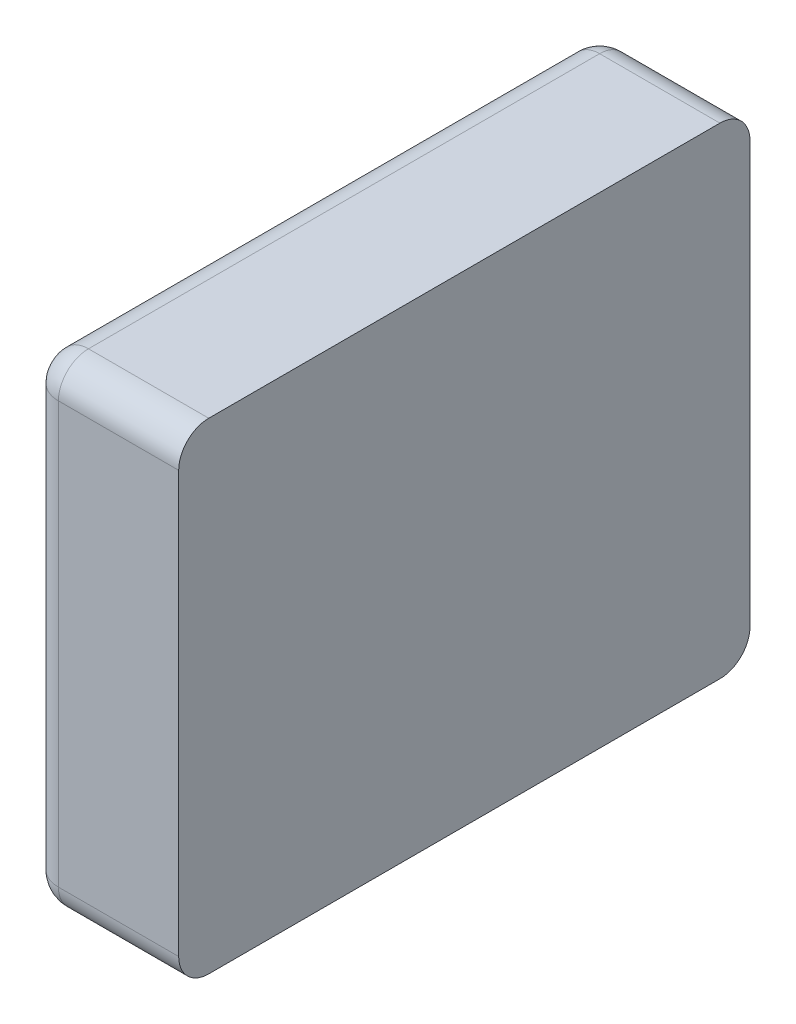
ISO-10303-21;
HEADER;
FILE_DESCRIPTION(('STEP AP214'),'2;1');
FILE_NAME('part.step','',(''),(''),'','','');
FILE_SCHEMA(('AUTOMOTIVE_DESIGN { 1 0 10303 214 1 1 1 1 }'));
ENDSEC;
DATA;
#1=APPLICATION_CONTEXT('core data for automotive mechanical design processes');
#2=APPLICATION_PROTOCOL_DEFINITION('international standard','automotive_design',2000,#1);
#3=PRODUCT_CONTEXT('',#1,'mechanical');
#4=PRODUCT('Part','Part','',(#3));
#5=PRODUCT_RELATED_PRODUCT_CATEGORY('part','',(#4));
#6=PRODUCT_DEFINITION_FORMATION('','',#4);
#7=PRODUCT_DEFINITION_CONTEXT('part definition',#1,'design');
#8=PRODUCT_DEFINITION('design','',#6,#7);
#9=PRODUCT_DEFINITION_SHAPE('','',#8);
#10=(LENGTH_UNIT() NAMED_UNIT(*) SI_UNIT(.MILLI.,.METRE.));
#11=(NAMED_UNIT(*) PLANE_ANGLE_UNIT() SI_UNIT($,.RADIAN.));
#12=(NAMED_UNIT(*) SI_UNIT($,.STERADIAN.) SOLID_ANGLE_UNIT());
#13=UNCERTAINTY_MEASURE_WITH_UNIT(LENGTH_MEASURE(1.E-05),#10,'distance_accuracy_value','');
#14=(GEOMETRIC_REPRESENTATION_CONTEXT(3) GLOBAL_UNCERTAINTY_ASSIGNED_CONTEXT((#13)) GLOBAL_UNIT_ASSIGNED_CONTEXT((#10,
#11,#12)) REPRESENTATION_CONTEXT('',''));
#15=CARTESIAN_POINT('',(0.,0.,0.));
#16=DIRECTION('',(0.,0.,1.));
#17=DIRECTION('',(1.,0.,0.));
#18=AXIS2_PLACEMENT_3D('',#15,#16,#17);
#19=CARTESIAN_POINT('',(-1.6,0.,0.));
#20=DIRECTION('',(-1.,0.,0.));
#21=DIRECTION('',(0.,0.,1.));
#22=AXIS2_PLACEMENT_3D('',#19,#20,#21);
#23=PLANE('',#22);
#24=DIRECTION('',(0.,0.,1.));
#25=VECTOR('',#24,1.);
#26=CARTESIAN_POINT('',(-1.6,0.7,0.));
#27=LINE('',#26,#25);
#28=CARTESIAN_POINT('',(-1.6,0.7,0.0999999999999998));
#29=VERTEX_POINT('',#28);
#30=CARTESIAN_POINT('',(-1.6,0.7,1.8));
#31=VERTEX_POINT('',#30);
#32=EDGE_CURVE('E115',#29,#31,#27,.T.);
#33=ORIENTED_EDGE('',*,*,#32,.F.);
#34=DIRECTION('',(0.,1.,0.));
#35=VECTOR('',#34,1.);
#36=CARTESIAN_POINT('',(-1.6,0.,0.0999999999999998));
#37=LINE('',#36,#35);
#38=CARTESIAN_POINT('',(-1.6,-0.7005,0.1));
#39=VERTEX_POINT('',#38);
#40=EDGE_CURVE('E112',#39,#29,#37,.T.);
#41=ORIENTED_EDGE('',*,*,#40,.F.);
#42=DIRECTION('',(0.,0.,-1.));
#43=VECTOR('',#42,1.);
#44=CARTESIAN_POINT('',(-1.6,-0.7005,0.));
#45=LINE('',#44,#43);
#46=CARTESIAN_POINT('',(-1.6,-0.7005,1.8));
#47=VERTEX_POINT('',#46);
#48=EDGE_CURVE('E101',#47,#39,#45,.T.);
#49=ORIENTED_EDGE('',*,*,#48,.F.);
#50=DIRECTION('',(0.,-1.,0.));
#51=VECTOR('',#50,1.);
#52=CARTESIAN_POINT('',(-1.6,0.,1.8));
#53=LINE('',#52,#51);
#54=EDGE_CURVE('E155',#31,#47,#53,.T.);
#55=ORIENTED_EDGE('',*,*,#54,.F.);
#56=EDGE_LOOP('',(#33,#41,#49,#55));
#57=FACE_BOUND('',#56,.T.);
#58=ADVANCED_FACE('F17',(#57),#23,.T.);
#59=CARTESIAN_POINT('',(-1.5,-0.7005,0.1));
#60=DIRECTION('',(1.,0.,0.));
#61=DIRECTION('',(0.,1.,0.));
#62=AXIS2_PLACEMENT_3D('',#59,#60,#61);
#63=SPHERICAL_SURFACE('',#62,0.1);
#64=CARTESIAN_POINT('',(-1.5,-0.7005,0.1));
#65=DIRECTION('',(1.,0.,0.));
#66=DIRECTION('',(0.,0.,-1.));
#67=AXIS2_PLACEMENT_3D('',#64,#65,#66);
#68=CIRCLE('',#67,0.1);
#69=CARTESIAN_POINT('',(-1.5,-0.8005,0.1));
#70=VERTEX_POINT('',#69);
#71=CARTESIAN_POINT('',(-1.5,-0.7005,0.));
#72=VERTEX_POINT('',#71);
#73=EDGE_CURVE('E117',#70,#72,#68,.T.);
#74=ORIENTED_EDGE('',*,*,#73,.F.);
#75=CARTESIAN_POINT('',(-1.5,-0.7005,0.1));
#76=DIRECTION('',(0.,0.,-1.));
#77=DIRECTION('',(0.,1.,0.));
#78=AXIS2_PLACEMENT_3D('',#75,#76,#77);
#79=CIRCLE('',#78,0.1);
#80=EDGE_CURVE('E106',#39,#70,#79,.F.);
#81=ORIENTED_EDGE('',*,*,#80,.F.);
#82=CARTESIAN_POINT('',(-1.5,-0.7005,0.1));
#83=DIRECTION('',(0.,1.,0.));
#84=DIRECTION('',(0.,0.,1.));
#85=AXIS2_PLACEMENT_3D('',#82,#83,#84);
#86=CIRCLE('',#85,0.1);
#87=EDGE_CURVE('E118',#72,#39,#86,.T.);
#88=ORIENTED_EDGE('',*,*,#87,.F.);
#89=EDGE_LOOP('',(#74,#81,#88));
#90=FACE_BOUND('',#89,.T.);
#91=ADVANCED_FACE('F125',(#90),#63,.T.);
#92=CARTESIAN_POINT('',(-1.5,-0.7005,0.));
#93=DIRECTION('',(0.,0.,-1.));
#94=DIRECTION('',(0.,1.,0.));
#95=AXIS2_PLACEMENT_3D('',#92,#93,#94);
#96=CYLINDRICAL_SURFACE('',#95,0.1);
#97=CARTESIAN_POINT('',(-1.5,-0.7005,1.8));
#98=DIRECTION('',(0.,1.53318354607886E-11,-1.));
#99=DIRECTION('',(1.,0.,0.));
#100=AXIS2_PLACEMENT_3D('',#97,#98,#99);
#101=CIRCLE('',#100,0.1);
#102=CARTESIAN_POINT('',(-1.5,-0.8005,1.79999999999962));
#103=VERTEX_POINT('',#102);
#104=EDGE_CURVE('E108',#47,#103,#101,.F.);
#105=ORIENTED_EDGE('',*,*,#104,.F.);
#106=ORIENTED_EDGE('',*,*,#48,.T.);
#107=ORIENTED_EDGE('',*,*,#80,.T.);
#108=DIRECTION('',(0.,0.,1.));
#109=VECTOR('',#108,1.);
#110=CARTESIAN_POINT('',(-1.5,-0.8005,0.));
#111=LINE('',#110,#109);
#112=EDGE_CURVE('E170',#70,#103,#111,.T.);
#113=ORIENTED_EDGE('',*,*,#112,.T.);
#114=EDGE_LOOP('',(#105,#106,#107,#113));
#115=FACE_BOUND('',#114,.T.);
#116=ADVANCED_FACE('F103',(#115),#96,.T.);
#117=CARTESIAN_POINT('',(-1.5,-0.7005,1.8));
#118=DIRECTION('',(1.,0.,0.));
#119=DIRECTION('',(0.,1.,0.));
#120=AXIS2_PLACEMENT_3D('',#117,#118,#119);
#121=SPHERICAL_SURFACE('',#120,0.1);
#122=CARTESIAN_POINT('',(-1.5,-0.7005,1.8));
#123=DIRECTION('',(1.,0.,0.));
#124=DIRECTION('',(0.,0.,-1.));
#125=AXIS2_PLACEMENT_3D('',#122,#123,#124);
#126=CIRCLE('',#125,0.1);
#127=CARTESIAN_POINT('',(-1.5,-0.7005,1.9));
#128=VERTEX_POINT('',#127);
#129=EDGE_CURVE('E167',#128,#103,#126,.T.);
#130=ORIENTED_EDGE('',*,*,#129,.F.);
#131=CARTESIAN_POINT('',(-1.5,-0.7005,1.8));
#132=DIRECTION('',(0.,-1.,0.));
#133=DIRECTION('',(0.,0.,-1.));
#134=AXIS2_PLACEMENT_3D('',#131,#132,#133);
#135=CIRCLE('',#134,0.1);
#136=EDGE_CURVE('E151',#47,#128,#135,.F.);
#137=ORIENTED_EDGE('',*,*,#136,.F.);
#138=ORIENTED_EDGE('',*,*,#104,.T.);
#139=EDGE_LOOP('',(#130,#137,#138));
#140=FACE_BOUND('',#139,.T.);
#141=ADVANCED_FACE('F140',(#140),#121,.T.);
#142=CARTESIAN_POINT('',(-1.5,0.,1.8));
#143=DIRECTION('',(0.,-1.,0.));
#144=DIRECTION('',(0.,0.,-1.));
#145=AXIS2_PLACEMENT_3D('',#142,#143,#144);
#146=CYLINDRICAL_SURFACE('',#145,0.1);
#147=CARTESIAN_POINT('',(-1.5,0.7,1.8));
#148=DIRECTION('',(0.,-1.,0.));
#149=DIRECTION('',(1.,0.,0.));
#150=AXIS2_PLACEMENT_3D('',#147,#148,#149);
#151=CIRCLE('',#150,0.1);
#152=CARTESIAN_POINT('',(-1.5,0.7,1.9));
#153=VERTEX_POINT('',#152);
#154=EDGE_CURVE('E159',#31,#153,#151,.F.);
#155=ORIENTED_EDGE('',*,*,#154,.F.);
#156=ORIENTED_EDGE('',*,*,#54,.T.);
#157=ORIENTED_EDGE('',*,*,#136,.T.);
#158=DIRECTION('',(0.,1.,0.));
#159=VECTOR('',#158,1.);
#160=CARTESIAN_POINT('',(-1.5,-0.8005,1.9));
#161=LINE('',#160,#159);
#162=EDGE_CURVE('E283',#128,#153,#161,.T.);
#163=ORIENTED_EDGE('',*,*,#162,.T.);
#164=EDGE_LOOP('',(#155,#156,#157,#163));
#165=FACE_BOUND('',#164,.T.);
#166=ADVANCED_FACE('F144',(#165),#146,.T.);
#167=CARTESIAN_POINT('',(-1.5,0.7,1.8));
#168=DIRECTION('',(1.,0.,0.));
#169=DIRECTION('',(0.,1.,0.));
#170=AXIS2_PLACEMENT_3D('',#167,#168,#169);
#171=SPHERICAL_SURFACE('',#170,0.1);
#172=CARTESIAN_POINT('',(-1.5,0.7,1.8));
#173=DIRECTION('',(0.,0.,1.));
#174=DIRECTION('',(0.,-1.,0.));
#175=AXIS2_PLACEMENT_3D('',#172,#173,#174);
#176=CIRCLE('',#175,0.1);
#177=CARTESIAN_POINT('',(-1.5,0.8,1.8));
#178=VERTEX_POINT('',#177);
#179=EDGE_CURVE('E232',#31,#178,#176,.F.);
#180=ORIENTED_EDGE('',*,*,#179,.F.);
#181=ORIENTED_EDGE('',*,*,#154,.T.);
#182=CARTESIAN_POINT('',(-1.5,0.7,1.8));
#183=DIRECTION('',(1.,0.,0.));
#184=DIRECTION('',(0.,0.,-1.));
#185=AXIS2_PLACEMENT_3D('',#182,#183,#184);
#186=CIRCLE('',#185,0.1);
#187=EDGE_CURVE('E278',#178,#153,#186,.T.);
#188=ORIENTED_EDGE('',*,*,#187,.F.);
#189=EDGE_LOOP('',(#180,#181,#188));
#190=FACE_BOUND('',#189,.T.);
#191=ADVANCED_FACE('F219',(#190),#171,.T.);
#192=CARTESIAN_POINT('',(-1.5,0.7,0.));
#193=DIRECTION('',(0.,0.,1.));
#194=DIRECTION('',(0.,-1.,0.));
#195=AXIS2_PLACEMENT_3D('',#192,#193,#194);
#196=CYLINDRICAL_SURFACE('',#195,0.1);
#197=ORIENTED_EDGE('',*,*,#179,.T.);
#198=DIRECTION('',(0.,0.,-1.));
#199=VECTOR('',#198,1.);
#200=CARTESIAN_POINT('',(-1.5,0.8,0.));
#201=LINE('',#200,#199);
#202=CARTESIAN_POINT('',(-1.5,0.8,0.1));
#203=VERTEX_POINT('',#202);
#204=EDGE_CURVE('E188',#178,#203,#201,.T.);
#205=ORIENTED_EDGE('',*,*,#204,.T.);
#206=CARTESIAN_POINT('',(-1.5,0.7,0.1));
#207=DIRECTION('',(0.,0.,1.));
#208=DIRECTION('',(1.,0.,0.));
#209=AXIS2_PLACEMENT_3D('',#206,#207,#208);
#210=CIRCLE('',#209,0.1);
#211=EDGE_CURVE('E195',#29,#203,#210,.F.);
#212=ORIENTED_EDGE('',*,*,#211,.F.);
#213=ORIENTED_EDGE('',*,*,#32,.T.);
#214=EDGE_LOOP('',(#197,#205,#212,#213));
#215=FACE_BOUND('',#214,.T.);
#216=ADVANCED_FACE('F215',(#215),#196,.T.);
#217=CARTESIAN_POINT('',(-1.5,0.7,0.1));
#218=DIRECTION('',(1.,0.,0.));
#219=DIRECTION('',(0.,1.,0.));
#220=AXIS2_PLACEMENT_3D('',#217,#218,#219);
#221=SPHERICAL_SURFACE('',#220,0.1);
#222=CARTESIAN_POINT('',(-1.5,0.7,0.0999999999999999));
#223=DIRECTION('',(0.,1.,0.));
#224=DIRECTION('',(0.,0.,1.));
#225=AXIS2_PLACEMENT_3D('',#222,#223,#224);
#226=CIRCLE('',#225,0.1);
#227=CARTESIAN_POINT('',(-1.5,0.7,0.));
#228=VERTEX_POINT('',#227);
#229=EDGE_CURVE('E66',#29,#228,#226,.F.);
#230=ORIENTED_EDGE('',*,*,#229,.F.);
#231=ORIENTED_EDGE('',*,*,#211,.T.);
#232=CARTESIAN_POINT('',(-1.5,0.7,0.1));
#233=DIRECTION('',(1.,0.,0.));
#234=DIRECTION('',(0.,0.,-1.));
#235=AXIS2_PLACEMENT_3D('',#232,#233,#234);
#236=CIRCLE('',#235,0.1);
#237=EDGE_CURVE('E184',#228,#203,#236,.T.);
#238=ORIENTED_EDGE('',*,*,#237,.F.);
#239=EDGE_LOOP('',(#230,#231,#238));
#240=FACE_BOUND('',#239,.T.);
#241=ADVANCED_FACE('F211',(#240),#221,.T.);
#242=CARTESIAN_POINT('',(-1.5,0.,0.1));
#243=DIRECTION('',(0.,1.,0.));
#244=DIRECTION('',(0.,0.,1.));
#245=AXIS2_PLACEMENT_3D('',#242,#243,#244);
#246=CYLINDRICAL_SURFACE('',#245,0.1);
#247=ORIENTED_EDGE('',*,*,#87,.T.);
#248=ORIENTED_EDGE('',*,*,#40,.T.);
#249=ORIENTED_EDGE('',*,*,#229,.T.);
#250=DIRECTION('',(0.,-1.,0.));
#251=VECTOR('',#250,1.);
#252=CARTESIAN_POINT('',(-1.5,-0.8005,0.));
#253=LINE('',#252,#251);
#254=EDGE_CURVE('E122',#228,#72,#253,.T.);
#255=ORIENTED_EDGE('',*,*,#254,.T.);
#256=EDGE_LOOP('',(#247,#248,#249,#255));
#257=FACE_BOUND('',#256,.T.);
#258=ADVANCED_FACE('F121',(#257),#246,.T.);
#259=CARTESIAN_POINT('',(-1.6,-0.7005,0.1));
#260=DIRECTION('',(1.,0.,0.));
#261=DIRECTION('',(0.,0.,-1.));
#262=AXIS2_PLACEMENT_3D('',#259,#260,#261);
#263=CYLINDRICAL_SURFACE('',#262,0.1);
#264=ORIENTED_EDGE('',*,*,#73,.T.);
#265=DIRECTION('',(1.,0.,0.));
#266=VECTOR('',#265,1.);
#267=CARTESIAN_POINT('',(-1.6,-0.7005,0.));
#268=LINE('',#267,#266);
#269=CARTESIAN_POINT('',(-1.1,-0.7005,0.));
#270=VERTEX_POINT('',#269);
#271=EDGE_CURVE('E263',#72,#270,#268,.T.);
#272=ORIENTED_EDGE('',*,*,#271,.T.);
#273=CARTESIAN_POINT('',(-1.1,-0.7005,0.1));
#274=DIRECTION('',(1.,0.,0.));
#275=DIRECTION('',(0.,0.,-1.));
#276=AXIS2_PLACEMENT_3D('',#273,#274,#275);
#277=CIRCLE('',#276,0.1);
#278=CARTESIAN_POINT('',(-1.1,-0.8005,0.1));
#279=VERTEX_POINT('',#278);
#280=EDGE_CURVE('E20',#270,#279,#277,.F.);
#281=ORIENTED_EDGE('',*,*,#280,.T.);
#282=DIRECTION('',(1.,0.,0.));
#283=VECTOR('',#282,1.);
#284=CARTESIAN_POINT('',(-1.6,-0.8005,0.1));
#285=LINE('',#284,#283);
#286=EDGE_CURVE('E172',#279,#70,#285,.F.);
#287=ORIENTED_EDGE('',*,*,#286,.T.);
#288=EDGE_LOOP('',(#264,#272,#281,#287));
#289=FACE_BOUND('',#288,.T.);
#290=ADVANCED_FACE('F312',(#289),#263,.T.);
#291=CARTESIAN_POINT('',(-1.6,-0.8005,0.));
#292=DIRECTION('',(0.,1.,0.));
#293=DIRECTION('',(0.,0.,1.));
#294=AXIS2_PLACEMENT_3D('',#291,#292,#293);
#295=PLANE('',#294);
#296=DIRECTION('',(1.,0.,0.));
#297=VECTOR('',#296,1.);
#298=CARTESIAN_POINT('',(-1.6,-0.8005,1.8));
#299=LINE('',#298,#297);
#300=CARTESIAN_POINT('',(-1.1,-0.8005,1.8));
#301=VERTEX_POINT('',#300);
#302=EDGE_CURVE('E169',#103,#301,#299,.T.);
#303=ORIENTED_EDGE('',*,*,#302,.F.);
#304=ORIENTED_EDGE('',*,*,#112,.F.);
#305=ORIENTED_EDGE('',*,*,#286,.F.);
#306=DIRECTION('',(0.,0.,1.));
#307=VECTOR('',#306,1.);
#308=CARTESIAN_POINT('',(-1.1,-0.8005,0.));
#309=LINE('',#308,#307);
#310=EDGE_CURVE('E251',#279,#301,#309,.T.);
#311=ORIENTED_EDGE('',*,*,#310,.T.);
#312=EDGE_LOOP('',(#303,#304,#305,#311));
#313=FACE_BOUND('',#312,.T.);
#314=ADVANCED_FACE('F314',(#313),#295,.F.);
#315=CARTESIAN_POINT('',(-1.6,-0.7005,1.8));
#316=DIRECTION('',(1.,0.,0.));
#317=DIRECTION('',(0.,0.,-1.));
#318=AXIS2_PLACEMENT_3D('',#315,#316,#317);
#319=CYLINDRICAL_SURFACE('',#318,0.1);
#320=ORIENTED_EDGE('',*,*,#129,.T.);
#321=ORIENTED_EDGE('',*,*,#302,.T.);
#322=CARTESIAN_POINT('',(-1.1,-0.7005,1.8));
#323=DIRECTION('',(1.,0.,0.));
#324=DIRECTION('',(0.,0.,-1.));
#325=AXIS2_PLACEMENT_3D('',#322,#323,#324);
#326=CIRCLE('',#325,0.1);
#327=CARTESIAN_POINT('',(-1.1,-0.7005,1.9));
#328=VERTEX_POINT('',#327);
#329=EDGE_CURVE('E249',#301,#328,#326,.F.);
#330=ORIENTED_EDGE('',*,*,#329,.T.);
#331=DIRECTION('',(1.,0.,0.));
#332=VECTOR('',#331,1.);
#333=CARTESIAN_POINT('',(-1.6,-0.7005,1.9));
#334=LINE('',#333,#332);
#335=EDGE_CURVE('E281',#328,#128,#334,.F.);
#336=ORIENTED_EDGE('',*,*,#335,.T.);
#337=EDGE_LOOP('',(#320,#321,#330,#336));
#338=FACE_BOUND('',#337,.T.);
#339=ADVANCED_FACE('F285',(#338),#319,.T.);
#340=CARTESIAN_POINT('',(-1.6,-0.8005,1.9));
#341=DIRECTION('',(0.,0.,-1.));
#342=DIRECTION('',(0.,1.,0.));
#343=AXIS2_PLACEMENT_3D('',#340,#341,#342);
#344=PLANE('',#343);
#345=DIRECTION('',(1.,0.,0.));
#346=VECTOR('',#345,1.);
#347=CARTESIAN_POINT('',(-1.6,0.7,1.9));
#348=LINE('',#347,#346);
#349=CARTESIAN_POINT('',(-1.1,0.7,1.9));
#350=VERTEX_POINT('',#349);
#351=EDGE_CURVE('E274',#153,#350,#348,.T.);
#352=ORIENTED_EDGE('',*,*,#351,.F.);
#353=ORIENTED_EDGE('',*,*,#162,.F.);
#354=ORIENTED_EDGE('',*,*,#335,.F.);
#355=DIRECTION('',(0.,1.,0.));
#356=VECTOR('',#355,1.);
#357=CARTESIAN_POINT('',(-1.1,0.,1.9));
#358=LINE('',#357,#356);
#359=EDGE_CURVE('E248',#328,#350,#358,.T.);
#360=ORIENTED_EDGE('',*,*,#359,.T.);
#361=EDGE_LOOP('',(#352,#353,#354,#360));
#362=FACE_BOUND('',#361,.T.);
#363=ADVANCED_FACE('F293',(#362),#344,.F.);
#364=CARTESIAN_POINT('',(-1.6,0.7,1.8));
#365=DIRECTION('',(1.,0.,0.));
#366=DIRECTION('',(0.,0.,-1.));
#367=AXIS2_PLACEMENT_3D('',#364,#365,#366);
#368=CYLINDRICAL_SURFACE('',#367,0.1);
#369=ORIENTED_EDGE('',*,*,#187,.T.);
#370=ORIENTED_EDGE('',*,*,#351,.T.);
#371=CARTESIAN_POINT('',(-1.1,0.7,1.8));
#372=DIRECTION('',(1.,0.,0.));
#373=DIRECTION('',(0.,0.,-1.));
#374=AXIS2_PLACEMENT_3D('',#371,#372,#373);
#375=CIRCLE('',#374,0.1);
#376=CARTESIAN_POINT('',(-1.1,0.8,1.8));
#377=VERTEX_POINT('',#376);
#378=EDGE_CURVE('E246',#350,#377,#375,.F.);
#379=ORIENTED_EDGE('',*,*,#378,.T.);
#380=DIRECTION('',(1.,0.,0.));
#381=VECTOR('',#380,1.);
#382=CARTESIAN_POINT('',(-1.6,0.8,1.8));
#383=LINE('',#382,#381);
#384=EDGE_CURVE('E204',#377,#178,#383,.F.);
#385=ORIENTED_EDGE('',*,*,#384,.T.);
#386=EDGE_LOOP('',(#369,#370,#379,#385));
#387=FACE_BOUND('',#386,.T.);
#388=ADVANCED_FACE('F302',(#387),#368,.T.);
#389=CARTESIAN_POINT('',(-1.6,0.8,0.));
#390=DIRECTION('',(0.,-1.,0.));
#391=DIRECTION('',(0.,0.,-1.));
#392=AXIS2_PLACEMENT_3D('',#389,#390,#391);
#393=PLANE('',#392);
#394=DIRECTION('',(1.,0.,0.));
#395=VECTOR('',#394,1.);
#396=CARTESIAN_POINT('',(-1.6,0.8,0.1));
#397=LINE('',#396,#395);
#398=CARTESIAN_POINT('',(-1.1,0.8,0.1));
#399=VERTEX_POINT('',#398);
#400=EDGE_CURVE('E187',#203,#399,#397,.T.);
#401=ORIENTED_EDGE('',*,*,#400,.F.);
#402=ORIENTED_EDGE('',*,*,#204,.F.);
#403=ORIENTED_EDGE('',*,*,#384,.F.);
#404=DIRECTION('',(0.,0.,1.));
#405=VECTOR('',#404,1.);
#406=CARTESIAN_POINT('',(-1.1,0.8,0.));
#407=LINE('',#406,#405);
#408=EDGE_CURVE('E245',#377,#399,#407,.F.);
#409=ORIENTED_EDGE('',*,*,#408,.T.);
#410=EDGE_LOOP('',(#401,#402,#403,#409));
#411=FACE_BOUND('',#410,.T.);
#412=ADVANCED_FACE('F306',(#411),#393,.F.);
#413=CARTESIAN_POINT('',(-1.6,0.7,0.1));
#414=DIRECTION('',(1.,0.,0.));
#415=DIRECTION('',(0.,0.,-1.));
#416=AXIS2_PLACEMENT_3D('',#413,#414,#415);
#417=CYLINDRICAL_SURFACE('',#416,0.1);
#418=ORIENTED_EDGE('',*,*,#237,.T.);
#419=ORIENTED_EDGE('',*,*,#400,.T.);
#420=CARTESIAN_POINT('',(-1.1,0.7,0.1));
#421=DIRECTION('',(1.,0.,0.));
#422=DIRECTION('',(0.,0.,-1.));
#423=AXIS2_PLACEMENT_3D('',#420,#421,#422);
#424=CIRCLE('',#423,0.1);
#425=CARTESIAN_POINT('',(-1.1,0.7,0.));
#426=VERTEX_POINT('',#425);
#427=EDGE_CURVE('E26',#399,#426,#424,.F.);
#428=ORIENTED_EDGE('',*,*,#427,.T.);
#429=DIRECTION('',(1.,0.,0.));
#430=VECTOR('',#429,1.);
#431=CARTESIAN_POINT('',(-1.6,0.7,0.));
#432=LINE('',#431,#430);
#433=EDGE_CURVE('E34',#426,#228,#432,.F.);
#434=ORIENTED_EDGE('',*,*,#433,.T.);
#435=EDGE_LOOP('',(#418,#419,#428,#434));
#436=FACE_BOUND('',#435,.T.);
#437=ADVANCED_FACE('F309',(#436),#417,.T.);
#438=CARTESIAN_POINT('',(-1.6,-0.8005,0.));
#439=DIRECTION('',(0.,0.,1.));
#440=DIRECTION('',(0.,-1.,0.));
#441=AXIS2_PLACEMENT_3D('',#438,#439,#440);
#442=PLANE('',#441);
#443=ORIENTED_EDGE('',*,*,#433,.F.);
#444=DIRECTION('',(0.,1.,0.));
#445=VECTOR('',#444,1.);
#446=CARTESIAN_POINT('',(-1.1,0.,0.));
#447=LINE('',#446,#445);
#448=EDGE_CURVE('E11',#426,#270,#447,.F.);
#449=ORIENTED_EDGE('',*,*,#448,.T.);
#450=ORIENTED_EDGE('',*,*,#271,.F.);
#451=ORIENTED_EDGE('',*,*,#254,.F.);
#452=EDGE_LOOP('',(#443,#449,#450,#451));
#453=FACE_BOUND('',#452,.T.);
#454=ADVANCED_FACE('F311',(#453),#442,.F.);
#455=CARTESIAN_POINT('',(-1.1,0.,0.));
#456=DIRECTION('',(-1.,0.,0.));
#457=DIRECTION('',(0.,0.,1.));
#458=AXIS2_PLACEMENT_3D('',#455,#456,#457);
#459=PLANE('',#458);
#460=ORIENTED_EDGE('',*,*,#427,.F.);
#461=ORIENTED_EDGE('',*,*,#408,.F.);
#462=ORIENTED_EDGE('',*,*,#378,.F.);
#463=ORIENTED_EDGE('',*,*,#359,.F.);
#464=ORIENTED_EDGE('',*,*,#329,.F.);
#465=ORIENTED_EDGE('',*,*,#310,.F.);
#466=ORIENTED_EDGE('',*,*,#280,.F.);
#467=ORIENTED_EDGE('',*,*,#448,.F.);
#468=EDGE_LOOP('',(#460,#461,#462,#463,#464,#465,#466,#467));
#469=FACE_BOUND('',#468,.T.);
#470=ADVANCED_FACE('F288',(#469),#459,.F.);
#471=CLOSED_SHELL('',(#58,#91,#116,#141,#166,#191,#216,#241,#258,#290,#314,#339,#363,#388,#412,
#437,#454,#470));
#472=MANIFOLD_SOLID_BREP('B1',#471);
#473=ADVANCED_BREP_SHAPE_REPRESENTATION('',(#18,#472),#14);
#474=SHAPE_DEFINITION_REPRESENTATION(#9,#473);
ENDSEC;
END-ISO-10303-21;
